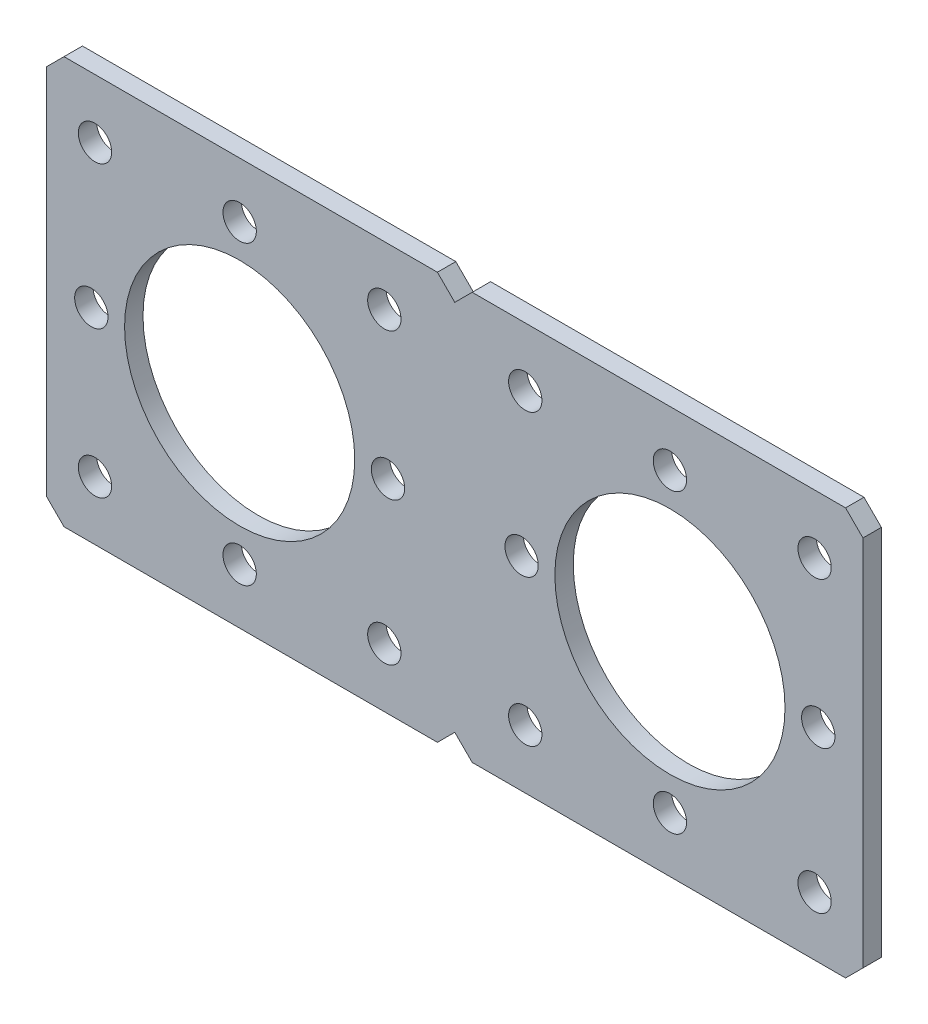
ISO-10303-21;
HEADER;
FILE_DESCRIPTION(('STEP AP214'),'2;1');
FILE_NAME('part.step','',(''),(''),'','','');
FILE_SCHEMA(('AUTOMOTIVE_DESIGN { 1 0 10303 214 1 1 1 1 }'));
ENDSEC;
DATA;
#1=APPLICATION_CONTEXT('core data for automotive mechanical design processes');
#2=APPLICATION_PROTOCOL_DEFINITION('international standard','automotive_design',2000,#1);
#3=PRODUCT_CONTEXT('',#1,'mechanical');
#4=PRODUCT('Part','Part','',(#3));
#5=PRODUCT_RELATED_PRODUCT_CATEGORY('part','',(#4));
#6=PRODUCT_DEFINITION_FORMATION('','',#4);
#7=PRODUCT_DEFINITION_CONTEXT('part definition',#1,'design');
#8=PRODUCT_DEFINITION('design','',#6,#7);
#9=PRODUCT_DEFINITION_SHAPE('','',#8);
#10=(LENGTH_UNIT() NAMED_UNIT(*) SI_UNIT(.MILLI.,.METRE.));
#11=(NAMED_UNIT(*) PLANE_ANGLE_UNIT() SI_UNIT($,.RADIAN.));
#12=(NAMED_UNIT(*) SI_UNIT($,.STERADIAN.) SOLID_ANGLE_UNIT());
#13=UNCERTAINTY_MEASURE_WITH_UNIT(LENGTH_MEASURE(1.E-05),#10,'distance_accuracy_value','');
#14=(GEOMETRIC_REPRESENTATION_CONTEXT(3) GLOBAL_UNCERTAINTY_ASSIGNED_CONTEXT((#13)) GLOBAL_UNIT_ASSIGNED_CONTEXT((#10,
#11,#12)) REPRESENTATION_CONTEXT('',''));
#15=CARTESIAN_POINT('',(0.,0.,0.));
#16=DIRECTION('',(0.,0.,1.));
#17=DIRECTION('',(1.,0.,0.));
#18=AXIS2_PLACEMENT_3D('',#15,#16,#17);
#19=CARTESIAN_POINT('',(-50.673,-25.273,0.));
#20=DIRECTION('',(0.,0.,1.));
#21=DIRECTION('',(1.,0.,0.));
#22=AXIS2_PLACEMENT_3D('',#19,#20,#21);
#23=PLANE('',#22);
#24=DIRECTION('',(-0.707106781186546,-0.707106781186549,0.));
#25=VECTOR('',#24,1.);
#26=CARTESIAN_POINT('',(-2.15899999999999,-25.273,0.));
#27=LINE('',#26,#25);
#28=CARTESIAN_POINT('',(0.,-23.114,0.));
#29=VERTEX_POINT('',#28);
#30=CARTESIAN_POINT('',(-2.15899999999998,-25.273,0.));
#31=VERTEX_POINT('',#30);
#32=EDGE_CURVE('E119',#29,#31,#27,.T.);
#33=ORIENTED_EDGE('',*,*,#32,.T.);
#34=DIRECTION('',(1.,0.,0.));
#35=VECTOR('',#34,1.);
#36=CARTESIAN_POINT('',(-50.673,-25.273,0.));
#37=LINE('',#36,#35);
#38=CARTESIAN_POINT('',(-48.514,-25.273,0.));
#39=VERTEX_POINT('',#38);
#40=EDGE_CURVE('E738',#31,#39,#37,.F.);
#41=ORIENTED_EDGE('',*,*,#40,.T.);
#42=DIRECTION('',(-0.707106781186548,0.707106781186548,0.));
#43=VECTOR('',#42,1.);
#44=CARTESIAN_POINT('',(-48.514,-25.273,0.));
#45=LINE('',#44,#43);
#46=CARTESIAN_POINT('',(-50.673,-23.114,0.));
#47=VERTEX_POINT('',#46);
#48=EDGE_CURVE('E742',#39,#47,#45,.T.);
#49=ORIENTED_EDGE('',*,*,#48,.T.);
#50=DIRECTION('',(0.,1.,0.));
#51=VECTOR('',#50,1.);
#52=CARTESIAN_POINT('',(-50.673,25.273,0.));
#53=LINE('',#52,#51);
#54=CARTESIAN_POINT('',(-50.673,23.114,0.));
#55=VERTEX_POINT('',#54);
#56=EDGE_CURVE('E746',#47,#55,#53,.T.);
#57=ORIENTED_EDGE('',*,*,#56,.T.);
#58=DIRECTION('',(0.707106781186548,0.707106781186548,0.));
#59=VECTOR('',#58,1.);
#60=CARTESIAN_POINT('',(-50.673,23.114,0.));
#61=LINE('',#60,#59);
#62=CARTESIAN_POINT('',(-48.514,25.273,0.));
#63=VERTEX_POINT('',#62);
#64=EDGE_CURVE('E750',#55,#63,#61,.T.);
#65=ORIENTED_EDGE('',*,*,#64,.T.);
#66=DIRECTION('',(1.,0.,0.));
#67=VECTOR('',#66,1.);
#68=CARTESIAN_POINT('',(-50.673,25.273,0.));
#69=LINE('',#68,#67);
#70=CARTESIAN_POINT('',(-2.15900000000001,25.273,0.));
#71=VERTEX_POINT('',#70);
#72=EDGE_CURVE('E754',#63,#71,#69,.T.);
#73=ORIENTED_EDGE('',*,*,#72,.T.);
#74=DIRECTION('',(0.707106781186546,-0.707106781186549,0.));
#75=VECTOR('',#74,1.);
#76=CARTESIAN_POINT('',(-2.15899999999999,25.273,0.));
#77=LINE('',#76,#75);
#78=CARTESIAN_POINT('',(0.,23.114,0.));
#79=VERTEX_POINT('',#78);
#80=EDGE_CURVE('E758',#71,#79,#77,.T.);
#81=ORIENTED_EDGE('',*,*,#80,.T.);
#82=DIRECTION('',(0.707106781186546,0.707106781186549,0.));
#83=VECTOR('',#82,1.);
#84=CARTESIAN_POINT('',(0.,23.114,0.));
#85=LINE('',#84,#83);
#86=CARTESIAN_POINT('',(2.15899999999998,25.273,0.));
#87=VERTEX_POINT('',#86);
#88=EDGE_CURVE('E762',#79,#87,#85,.T.);
#89=ORIENTED_EDGE('',*,*,#88,.T.);
#90=DIRECTION('',(1.,0.,0.));
#91=VECTOR('',#90,1.);
#92=CARTESIAN_POINT('',(-50.673,25.273,0.));
#93=LINE('',#92,#91);
#94=CARTESIAN_POINT('',(48.514,25.273,0.));
#95=VERTEX_POINT('',#94);
#96=EDGE_CURVE('E766',#87,#95,#93,.T.);
#97=ORIENTED_EDGE('',*,*,#96,.T.);
#98=DIRECTION('',(0.707106781186548,-0.707106781186548,0.));
#99=VECTOR('',#98,1.);
#100=CARTESIAN_POINT('',(48.514,25.273,0.));
#101=LINE('',#100,#99);
#102=CARTESIAN_POINT('',(50.673,23.114,0.));
#103=VERTEX_POINT('',#102);
#104=EDGE_CURVE('E770',#95,#103,#101,.T.);
#105=ORIENTED_EDGE('',*,*,#104,.T.);
#106=DIRECTION('',(0.,1.,0.));
#107=VECTOR('',#106,1.);
#108=CARTESIAN_POINT('',(50.673,25.273,0.));
#109=LINE('',#108,#107);
#110=CARTESIAN_POINT('',(50.673,-23.114,0.));
#111=VERTEX_POINT('',#110);
#112=EDGE_CURVE('E726',#103,#111,#109,.F.);
#113=ORIENTED_EDGE('',*,*,#112,.T.);
#114=DIRECTION('',(-0.707106781186548,-0.707106781186548,0.));
#115=VECTOR('',#114,1.);
#116=CARTESIAN_POINT('',(50.673,-23.114,0.));
#117=LINE('',#116,#115);
#118=CARTESIAN_POINT('',(48.514,-25.273,0.));
#119=VERTEX_POINT('',#118);
#120=EDGE_CURVE('E719',#111,#119,#117,.T.);
#121=ORIENTED_EDGE('',*,*,#120,.T.);
#122=DIRECTION('',(1.,0.,0.));
#123=VECTOR('',#122,1.);
#124=CARTESIAN_POINT('',(-50.673,-25.273,0.));
#125=LINE('',#124,#123);
#126=CARTESIAN_POINT('',(2.159,-25.273,0.));
#127=VERTEX_POINT('',#126);
#128=EDGE_CURVE('E114',#119,#127,#125,.F.);
#129=ORIENTED_EDGE('',*,*,#128,.T.);
#130=DIRECTION('',(-0.707106781186546,0.707106781186549,0.));
#131=VECTOR('',#130,1.);
#132=CARTESIAN_POINT('',(0.,-23.114,0.));
#133=LINE('',#132,#131);
#134=EDGE_CURVE('E116',#127,#29,#133,.T.);
#135=ORIENTED_EDGE('',*,*,#134,.T.);
#136=EDGE_LOOP('',(#33,#41,#49,#57,#65,#73,#81,#89,#97,#105,#113,#121,#129,#135));
#137=FACE_BOUND('',#136,.T.);
#138=CARTESIAN_POINT('',(-26.7081,-18.415,0.));
#139=DIRECTION('',(0.,0.,-1.));
#140=DIRECTION('',(-1.,0.,0.));
#141=AXIS2_PLACEMENT_3D('',#138,#139,#140);
#142=CIRCLE('',#141,2.0701);
#143=CARTESIAN_POINT('',(-28.7782,-18.415,0.));
#144=VERTEX_POINT('',#143);
#145=EDGE_CURVE('E132',#144,#144,#142,.F.);
#146=ORIENTED_EDGE('',*,*,#145,.T.);
#147=EDGE_LOOP('',(#146));
#148=FACE_BOUND('',#147,.T.);
#149=CARTESIAN_POINT('',(45.1231,0.,0.));
#150=DIRECTION('',(0.,0.,-1.));
#151=DIRECTION('',(-1.,0.,0.));
#152=AXIS2_PLACEMENT_3D('',#149,#150,#151);
#153=CIRCLE('',#152,2.07010000000001);
#154=CARTESIAN_POINT('',(43.053,0.,0.));
#155=VERTEX_POINT('',#154);
#156=EDGE_CURVE('E200',#155,#155,#153,.F.);
#157=ORIENTED_EDGE('',*,*,#156,.T.);
#158=EDGE_LOOP('',(#157));
#159=FACE_BOUND('',#158,.T.);
#160=CARTESIAN_POINT('',(-26.7080999999999,18.415,0.));
#161=DIRECTION('',(0.,0.,-1.));
#162=DIRECTION('',(-1.,0.,0.));
#163=AXIS2_PLACEMENT_3D('',#160,#161,#162);
#164=CIRCLE('',#163,2.0701);
#165=CARTESIAN_POINT('',(-28.7781999999999,18.415,0.));
#166=VERTEX_POINT('',#165);
#167=EDGE_CURVE('E203',#166,#166,#164,.F.);
#168=ORIENTED_EDGE('',*,*,#167,.T.);
#169=EDGE_LOOP('',(#168));
#170=FACE_BOUND('',#169,.T.);
#171=CARTESIAN_POINT('',(26.7080999999999,18.415,0.));
#172=DIRECTION('',(0.,0.,-1.));
#173=DIRECTION('',(-1.,0.,0.));
#174=AXIS2_PLACEMENT_3D('',#171,#172,#173);
#175=CIRCLE('',#174,2.0701);
#176=CARTESIAN_POINT('',(24.6379999999999,18.415,0.));
#177=VERTEX_POINT('',#176);
#178=EDGE_CURVE('E206',#177,#177,#175,.F.);
#179=ORIENTED_EDGE('',*,*,#178,.T.);
#180=EDGE_LOOP('',(#179));
#181=FACE_BOUND('',#180,.T.);
#182=CARTESIAN_POINT('',(-8.74758775786172,17.9605122421382,0.));
#183=DIRECTION('',(0.,0.,-1.));
#184=DIRECTION('',(-1.,0.,0.));
#185=AXIS2_PLACEMENT_3D('',#182,#183,#184);
#186=CIRCLE('',#185,2.0701);
#187=CARTESIAN_POINT('',(-10.8176877578617,17.9605122421382,0.));
#188=VERTEX_POINT('',#187);
#189=EDGE_CURVE('E209',#188,#188,#186,.F.);
#190=ORIENTED_EDGE('',*,*,#189,.T.);
#191=EDGE_LOOP('',(#190));
#192=FACE_BOUND('',#191,.T.);
#193=CARTESIAN_POINT('',(-44.6686122421384,17.9605122421382,0.));
#194=DIRECTION('',(0.,0.,-1.));
#195=DIRECTION('',(-1.,0.,0.));
#196=AXIS2_PLACEMENT_3D('',#193,#194,#195);
#197=CIRCLE('',#196,2.0701);
#198=CARTESIAN_POINT('',(-46.7387122421384,17.9605122421382,0.));
#199=VERTEX_POINT('',#198);
#200=EDGE_CURVE('E212',#199,#199,#197,.F.);
#201=ORIENTED_EDGE('',*,*,#200,.T.);
#202=EDGE_LOOP('',(#201));
#203=FACE_BOUND('',#202,.T.);
#204=CARTESIAN_POINT('',(-26.7081,0.,0.));
#205=DIRECTION('',(0.,0.,-1.));
#206=DIRECTION('',(-1.,0.,0.));
#207=AXIS2_PLACEMENT_3D('',#204,#205,#206);
#208=CIRCLE('',#207,14.2875);
#209=CARTESIAN_POINT('',(-40.9956,0.,0.));
#210=VERTEX_POINT('',#209);
#211=EDGE_CURVE('E215',#210,#210,#208,.F.);
#212=ORIENTED_EDGE('',*,*,#211,.T.);
#213=EDGE_LOOP('',(#212));
#214=FACE_BOUND('',#213,.T.);
#215=CARTESIAN_POINT('',(44.6686122421383,-17.9605122421383,0.));
#216=DIRECTION('',(0.,0.,-1.));
#217=DIRECTION('',(-1.,0.,0.));
#218=AXIS2_PLACEMENT_3D('',#215,#216,#217);
#219=CIRCLE('',#218,2.0701);
#220=CARTESIAN_POINT('',(42.5985122421383,-17.9605122421383,0.));
#221=VERTEX_POINT('',#220);
#222=EDGE_CURVE('E218',#221,#221,#219,.F.);
#223=ORIENTED_EDGE('',*,*,#222,.T.);
#224=EDGE_LOOP('',(#223));
#225=FACE_BOUND('',#224,.T.);
#226=CARTESIAN_POINT('',(8.74758775786166,17.9605122421383,0.));
#227=DIRECTION('',(0.,0.,-1.));
#228=DIRECTION('',(-1.,0.,0.));
#229=AXIS2_PLACEMENT_3D('',#226,#227,#228);
#230=CIRCLE('',#229,2.0701);
#231=CARTESIAN_POINT('',(6.67748775786166,17.9605122421383,0.));
#232=VERTEX_POINT('',#231);
#233=EDGE_CURVE('E221',#232,#232,#230,.F.);
#234=ORIENTED_EDGE('',*,*,#233,.T.);
#235=EDGE_LOOP('',(#234));
#236=FACE_BOUND('',#235,.T.);
#237=CARTESIAN_POINT('',(26.7081,0.,0.));
#238=DIRECTION('',(0.,0.,-1.));
#239=DIRECTION('',(-1.,0.,0.));
#240=AXIS2_PLACEMENT_3D('',#237,#238,#239);
#241=CIRCLE('',#240,14.2875);
#242=CARTESIAN_POINT('',(12.4206,0.,0.));
#243=VERTEX_POINT('',#242);
#244=EDGE_CURVE('E224',#243,#243,#241,.F.);
#245=ORIENTED_EDGE('',*,*,#244,.T.);
#246=EDGE_LOOP('',(#245));
#247=FACE_BOUND('',#246,.T.);
#248=CARTESIAN_POINT('',(8.74758775786161,-17.9605122421383,0.));
#249=DIRECTION('',(0.,0.,-1.));
#250=DIRECTION('',(-1.,0.,0.));
#251=AXIS2_PLACEMENT_3D('',#248,#249,#250);
#252=CIRCLE('',#251,2.0701);
#253=CARTESIAN_POINT('',(6.67748775786161,-17.9605122421383,0.));
#254=VERTEX_POINT('',#253);
#255=EDGE_CURVE('E227',#254,#254,#252,.F.);
#256=ORIENTED_EDGE('',*,*,#255,.T.);
#257=EDGE_LOOP('',(#256));
#258=FACE_BOUND('',#257,.T.);
#259=CARTESIAN_POINT('',(44.6686122421383,17.9605122421382,0.));
#260=DIRECTION('',(0.,0.,-1.));
#261=DIRECTION('',(-1.,0.,0.));
#262=AXIS2_PLACEMENT_3D('',#259,#260,#261);
#263=CIRCLE('',#262,2.0701);
#264=CARTESIAN_POINT('',(42.5985122421383,17.9605122421382,0.));
#265=VERTEX_POINT('',#264);
#266=EDGE_CURVE('E230',#265,#265,#263,.F.);
#267=ORIENTED_EDGE('',*,*,#266,.T.);
#268=EDGE_LOOP('',(#267));
#269=FACE_BOUND('',#268,.T.);
#270=CARTESIAN_POINT('',(-44.6686122421382,-17.9605122421383,0.));
#271=DIRECTION('',(0.,0.,-1.));
#272=DIRECTION('',(-1.,0.,0.));
#273=AXIS2_PLACEMENT_3D('',#270,#271,#272);
#274=CIRCLE('',#273,2.0701);
#275=CARTESIAN_POINT('',(-46.7387122421382,-17.9605122421383,0.));
#276=VERTEX_POINT('',#275);
#277=EDGE_CURVE('E233',#276,#276,#274,.F.);
#278=ORIENTED_EDGE('',*,*,#277,.T.);
#279=EDGE_LOOP('',(#278));
#280=FACE_BOUND('',#279,.T.);
#281=CARTESIAN_POINT('',(-8.7475877578617,-17.9605122421383,0.));
#282=DIRECTION('',(0.,0.,-1.));
#283=DIRECTION('',(-1.,0.,0.));
#284=AXIS2_PLACEMENT_3D('',#281,#282,#283);
#285=CIRCLE('',#284,2.0701);
#286=CARTESIAN_POINT('',(-10.8176877578617,-17.9605122421383,0.));
#287=VERTEX_POINT('',#286);
#288=EDGE_CURVE('E236',#287,#287,#285,.F.);
#289=ORIENTED_EDGE('',*,*,#288,.T.);
#290=EDGE_LOOP('',(#289));
#291=FACE_BOUND('',#290,.T.);
#292=CARTESIAN_POINT('',(8.29310000000001,-1.73472347597681E-13,0.));
#293=DIRECTION('',(0.,0.,-1.));
#294=DIRECTION('',(-1.,0.,0.));
#295=AXIS2_PLACEMENT_3D('',#292,#293,#294);
#296=CIRCLE('',#295,2.0701);
#297=CARTESIAN_POINT('',(6.22300000000001,-1.73472347597681E-13,0.));
#298=VERTEX_POINT('',#297);
#299=EDGE_CURVE('E239',#298,#298,#296,.F.);
#300=ORIENTED_EDGE('',*,*,#299,.T.);
#301=EDGE_LOOP('',(#300));
#302=FACE_BOUND('',#301,.T.);
#303=CARTESIAN_POINT('',(-45.1231,0.,0.));
#304=DIRECTION('',(0.,0.,-1.));
#305=DIRECTION('',(-1.,0.,0.));
#306=AXIS2_PLACEMENT_3D('',#303,#304,#305);
#307=CIRCLE('',#306,2.07010000000001);
#308=CARTESIAN_POINT('',(-47.1932,0.,0.));
#309=VERTEX_POINT('',#308);
#310=EDGE_CURVE('E242',#309,#309,#307,.F.);
#311=ORIENTED_EDGE('',*,*,#310,.T.);
#312=EDGE_LOOP('',(#311));
#313=FACE_BOUND('',#312,.T.);
#314=CARTESIAN_POINT('',(-8.2931,-1.87350135405495E-13,0.));
#315=DIRECTION('',(0.,0.,-1.));
#316=DIRECTION('',(-1.,0.,0.));
#317=AXIS2_PLACEMENT_3D('',#314,#315,#316);
#318=CIRCLE('',#317,2.0701);
#319=CARTESIAN_POINT('',(-10.3632,-1.87350135405495E-13,0.));
#320=VERTEX_POINT('',#319);
#321=EDGE_CURVE('E244',#320,#320,#318,.F.);
#322=ORIENTED_EDGE('',*,*,#321,.T.);
#323=EDGE_LOOP('',(#322));
#324=FACE_BOUND('',#323,.T.);
#325=CARTESIAN_POINT('',(26.7081,-18.415,0.));
#326=DIRECTION('',(0.,0.,-1.));
#327=DIRECTION('',(-1.,0.,0.));
#328=AXIS2_PLACEMENT_3D('',#325,#326,#327);
#329=CIRCLE('',#328,2.0701);
#330=CARTESIAN_POINT('',(24.638,-18.415,0.));
#331=VERTEX_POINT('',#330);
#332=EDGE_CURVE('E18',#331,#331,#329,.F.);
#333=ORIENTED_EDGE('',*,*,#332,.T.);
#334=EDGE_LOOP('',(#333));
#335=FACE_BOUND('',#334,.T.);
#336=ADVANCED_FACE('F15',(#137,#148,#159,#170,#181,#192,#203,#214,#225,#236,#247,#258,#269,#280,
#291,#302,#313,#324,#335),#23,.F.);
#337=CARTESIAN_POINT('',(26.7081,-18.415,2.286));
#338=DIRECTION('',(0.,0.,-1.));
#339=DIRECTION('',(-1.,0.,0.));
#340=AXIS2_PLACEMENT_3D('',#337,#338,#339);
#341=CYLINDRICAL_SURFACE('',#340,2.0701);
#342=CARTESIAN_POINT('',(26.7081,-18.415,2.286));
#343=DIRECTION('',(0.,0.,-1.));
#344=DIRECTION('',(-1.,0.,0.));
#345=AXIS2_PLACEMENT_3D('',#342,#343,#344);
#346=CIRCLE('',#345,2.0701);
#347=CARTESIAN_POINT('',(24.638,-18.415,2.286));
#348=VERTEX_POINT('',#347);
#349=EDGE_CURVE('E195',#348,#348,#346,.T.);
#350=ORIENTED_EDGE('',*,*,#349,.F.);
#351=EDGE_LOOP('',(#350));
#352=FACE_BOUND('',#351,.T.);
#353=ORIENTED_EDGE('',*,*,#332,.F.);
#354=EDGE_LOOP('',(#353));
#355=FACE_BOUND('',#354,.T.);
#356=ADVANCED_FACE('F252',(#352,#355),#341,.F.);
#357=CARTESIAN_POINT('',(-8.2931,-1.87350135405495E-13,2.286));
#358=DIRECTION('',(0.,0.,-1.));
#359=DIRECTION('',(-1.,0.,0.));
#360=AXIS2_PLACEMENT_3D('',#357,#358,#359);
#361=CYLINDRICAL_SURFACE('',#360,2.0701);
#362=CARTESIAN_POINT('',(-8.2931,-1.87350135405495E-13,2.286));
#363=DIRECTION('',(0.,0.,-1.));
#364=DIRECTION('',(-1.,0.,0.));
#365=AXIS2_PLACEMENT_3D('',#362,#363,#364);
#366=CIRCLE('',#365,2.0701);
#367=CARTESIAN_POINT('',(-10.3632,-1.87350135405495E-13,2.286));
#368=VERTEX_POINT('',#367);
#369=EDGE_CURVE('E192',#368,#368,#366,.T.);
#370=ORIENTED_EDGE('',*,*,#369,.F.);
#371=EDGE_LOOP('',(#370));
#372=FACE_BOUND('',#371,.T.);
#373=ORIENTED_EDGE('',*,*,#321,.F.);
#374=EDGE_LOOP('',(#373));
#375=FACE_BOUND('',#374,.T.);
#376=ADVANCED_FACE('F254',(#372,#375),#361,.F.);
#377=CARTESIAN_POINT('',(-45.1231,0.,2.286));
#378=DIRECTION('',(0.,0.,-1.));
#379=DIRECTION('',(-1.,0.,0.));
#380=AXIS2_PLACEMENT_3D('',#377,#378,#379);
#381=CYLINDRICAL_SURFACE('',#380,2.07010000000001);
#382=CARTESIAN_POINT('',(-45.1231,0.,2.286));
#383=DIRECTION('',(0.,0.,-1.));
#384=DIRECTION('',(-1.,0.,0.));
#385=AXIS2_PLACEMENT_3D('',#382,#383,#384);
#386=CIRCLE('',#385,2.07010000000001);
#387=CARTESIAN_POINT('',(-47.1932,0.,2.286));
#388=VERTEX_POINT('',#387);
#389=EDGE_CURVE('E189',#388,#388,#386,.T.);
#390=ORIENTED_EDGE('',*,*,#389,.F.);
#391=EDGE_LOOP('',(#390));
#392=FACE_BOUND('',#391,.T.);
#393=ORIENTED_EDGE('',*,*,#310,.F.);
#394=EDGE_LOOP('',(#393));
#395=FACE_BOUND('',#394,.T.);
#396=ADVANCED_FACE('F261',(#392,#395),#381,.F.);
#397=CARTESIAN_POINT('',(8.29310000000001,-1.73472347597681E-13,2.286));
#398=DIRECTION('',(0.,0.,-1.));
#399=DIRECTION('',(-1.,0.,0.));
#400=AXIS2_PLACEMENT_3D('',#397,#398,#399);
#401=CYLINDRICAL_SURFACE('',#400,2.0701);
#402=CARTESIAN_POINT('',(8.29310000000001,-1.73472347597681E-13,2.286));
#403=DIRECTION('',(0.,0.,-1.));
#404=DIRECTION('',(-1.,0.,0.));
#405=AXIS2_PLACEMENT_3D('',#402,#403,#404);
#406=CIRCLE('',#405,2.0701);
#407=CARTESIAN_POINT('',(6.22300000000001,-1.73472347597681E-13,2.286));
#408=VERTEX_POINT('',#407);
#409=EDGE_CURVE('E186',#408,#408,#406,.T.);
#410=ORIENTED_EDGE('',*,*,#409,.F.);
#411=EDGE_LOOP('',(#410));
#412=FACE_BOUND('',#411,.T.);
#413=ORIENTED_EDGE('',*,*,#299,.F.);
#414=EDGE_LOOP('',(#413));
#415=FACE_BOUND('',#414,.T.);
#416=ADVANCED_FACE('F380',(#412,#415),#401,.F.);
#417=CARTESIAN_POINT('',(-8.7475877578617,-17.9605122421383,2.286));
#418=DIRECTION('',(0.,0.,-1.));
#419=DIRECTION('',(-1.,0.,0.));
#420=AXIS2_PLACEMENT_3D('',#417,#418,#419);
#421=CYLINDRICAL_SURFACE('',#420,2.0701);
#422=CARTESIAN_POINT('',(-8.7475877578617,-17.9605122421383,2.286));
#423=DIRECTION('',(0.,0.,-1.));
#424=DIRECTION('',(-1.,0.,0.));
#425=AXIS2_PLACEMENT_3D('',#422,#423,#424);
#426=CIRCLE('',#425,2.0701);
#427=CARTESIAN_POINT('',(-10.8176877578617,-17.9605122421383,2.286));
#428=VERTEX_POINT('',#427);
#429=EDGE_CURVE('E183',#428,#428,#426,.T.);
#430=ORIENTED_EDGE('',*,*,#429,.F.);
#431=EDGE_LOOP('',(#430));
#432=FACE_BOUND('',#431,.T.);
#433=ORIENTED_EDGE('',*,*,#288,.F.);
#434=EDGE_LOOP('',(#433));
#435=FACE_BOUND('',#434,.T.);
#436=ADVANCED_FACE('F376',(#432,#435),#421,.F.);
#437=CARTESIAN_POINT('',(-44.6686122421382,-17.9605122421383,2.286));
#438=DIRECTION('',(0.,0.,-1.));
#439=DIRECTION('',(-1.,0.,0.));
#440=AXIS2_PLACEMENT_3D('',#437,#438,#439);
#441=CYLINDRICAL_SURFACE('',#440,2.0701);
#442=CARTESIAN_POINT('',(-44.6686122421382,-17.9605122421383,2.286));
#443=DIRECTION('',(0.,0.,-1.));
#444=DIRECTION('',(-1.,0.,0.));
#445=AXIS2_PLACEMENT_3D('',#442,#443,#444);
#446=CIRCLE('',#445,2.0701);
#447=CARTESIAN_POINT('',(-46.7387122421382,-17.9605122421383,2.286));
#448=VERTEX_POINT('',#447);
#449=EDGE_CURVE('E180',#448,#448,#446,.T.);
#450=ORIENTED_EDGE('',*,*,#449,.F.);
#451=EDGE_LOOP('',(#450));
#452=FACE_BOUND('',#451,.T.);
#453=ORIENTED_EDGE('',*,*,#277,.F.);
#454=EDGE_LOOP('',(#453));
#455=FACE_BOUND('',#454,.T.);
#456=ADVANCED_FACE('F372',(#452,#455),#441,.F.);
#457=CARTESIAN_POINT('',(44.6686122421383,17.9605122421382,2.286));
#458=DIRECTION('',(0.,0.,-1.));
#459=DIRECTION('',(-1.,0.,0.));
#460=AXIS2_PLACEMENT_3D('',#457,#458,#459);
#461=CYLINDRICAL_SURFACE('',#460,2.0701);
#462=CARTESIAN_POINT('',(44.6686122421383,17.9605122421382,2.286));
#463=DIRECTION('',(0.,0.,-1.));
#464=DIRECTION('',(-1.,0.,0.));
#465=AXIS2_PLACEMENT_3D('',#462,#463,#464);
#466=CIRCLE('',#465,2.0701);
#467=CARTESIAN_POINT('',(42.5985122421383,17.9605122421382,2.286));
#468=VERTEX_POINT('',#467);
#469=EDGE_CURVE('E177',#468,#468,#466,.T.);
#470=ORIENTED_EDGE('',*,*,#469,.F.);
#471=EDGE_LOOP('',(#470));
#472=FACE_BOUND('',#471,.T.);
#473=ORIENTED_EDGE('',*,*,#266,.F.);
#474=EDGE_LOOP('',(#473));
#475=FACE_BOUND('',#474,.T.);
#476=ADVANCED_FACE('F368',(#472,#475),#461,.F.);
#477=CARTESIAN_POINT('',(8.74758775786161,-17.9605122421383,2.286));
#478=DIRECTION('',(0.,0.,-1.));
#479=DIRECTION('',(-1.,0.,0.));
#480=AXIS2_PLACEMENT_3D('',#477,#478,#479);
#481=CYLINDRICAL_SURFACE('',#480,2.0701);
#482=CARTESIAN_POINT('',(8.74758775786161,-17.9605122421383,2.286));
#483=DIRECTION('',(0.,0.,-1.));
#484=DIRECTION('',(-1.,0.,0.));
#485=AXIS2_PLACEMENT_3D('',#482,#483,#484);
#486=CIRCLE('',#485,2.0701);
#487=CARTESIAN_POINT('',(6.67748775786161,-17.9605122421383,2.286));
#488=VERTEX_POINT('',#487);
#489=EDGE_CURVE('E174',#488,#488,#486,.T.);
#490=ORIENTED_EDGE('',*,*,#489,.F.);
#491=EDGE_LOOP('',(#490));
#492=FACE_BOUND('',#491,.T.);
#493=ORIENTED_EDGE('',*,*,#255,.F.);
#494=EDGE_LOOP('',(#493));
#495=FACE_BOUND('',#494,.T.);
#496=ADVANCED_FACE('F364',(#492,#495),#481,.F.);
#497=CARTESIAN_POINT('',(26.7081,0.,2.286));
#498=DIRECTION('',(0.,0.,-1.));
#499=DIRECTION('',(-1.,0.,0.));
#500=AXIS2_PLACEMENT_3D('',#497,#498,#499);
#501=CYLINDRICAL_SURFACE('',#500,14.2875);
#502=CARTESIAN_POINT('',(26.7081,0.,2.286));
#503=DIRECTION('',(0.,0.,-1.));
#504=DIRECTION('',(-1.,0.,0.));
#505=AXIS2_PLACEMENT_3D('',#502,#503,#504);
#506=CIRCLE('',#505,14.2875);
#507=CARTESIAN_POINT('',(12.4206,0.,2.286));
#508=VERTEX_POINT('',#507);
#509=EDGE_CURVE('E171',#508,#508,#506,.T.);
#510=ORIENTED_EDGE('',*,*,#509,.F.);
#511=EDGE_LOOP('',(#510));
#512=FACE_BOUND('',#511,.T.);
#513=ORIENTED_EDGE('',*,*,#244,.F.);
#514=EDGE_LOOP('',(#513));
#515=FACE_BOUND('',#514,.T.);
#516=ADVANCED_FACE('F360',(#512,#515),#501,.F.);
#517=CARTESIAN_POINT('',(8.74758775786166,17.9605122421383,2.286));
#518=DIRECTION('',(0.,0.,-1.));
#519=DIRECTION('',(-1.,0.,0.));
#520=AXIS2_PLACEMENT_3D('',#517,#518,#519);
#521=CYLINDRICAL_SURFACE('',#520,2.0701);
#522=CARTESIAN_POINT('',(8.74758775786166,17.9605122421383,2.286));
#523=DIRECTION('',(0.,0.,-1.));
#524=DIRECTION('',(-1.,0.,0.));
#525=AXIS2_PLACEMENT_3D('',#522,#523,#524);
#526=CIRCLE('',#525,2.0701);
#527=CARTESIAN_POINT('',(6.67748775786166,17.9605122421383,2.286));
#528=VERTEX_POINT('',#527);
#529=EDGE_CURVE('E168',#528,#528,#526,.T.);
#530=ORIENTED_EDGE('',*,*,#529,.F.);
#531=EDGE_LOOP('',(#530));
#532=FACE_BOUND('',#531,.T.);
#533=ORIENTED_EDGE('',*,*,#233,.F.);
#534=EDGE_LOOP('',(#533));
#535=FACE_BOUND('',#534,.T.);
#536=ADVANCED_FACE('F356',(#532,#535),#521,.F.);
#537=CARTESIAN_POINT('',(44.6686122421383,-17.9605122421383,2.286));
#538=DIRECTION('',(0.,0.,-1.));
#539=DIRECTION('',(-1.,0.,0.));
#540=AXIS2_PLACEMENT_3D('',#537,#538,#539);
#541=CYLINDRICAL_SURFACE('',#540,2.0701);
#542=CARTESIAN_POINT('',(44.6686122421383,-17.9605122421383,2.286));
#543=DIRECTION('',(0.,0.,-1.));
#544=DIRECTION('',(-1.,0.,0.));
#545=AXIS2_PLACEMENT_3D('',#542,#543,#544);
#546=CIRCLE('',#545,2.0701);
#547=CARTESIAN_POINT('',(42.5985122421383,-17.9605122421383,2.286));
#548=VERTEX_POINT('',#547);
#549=EDGE_CURVE('E165',#548,#548,#546,.T.);
#550=ORIENTED_EDGE('',*,*,#549,.F.);
#551=EDGE_LOOP('',(#550));
#552=FACE_BOUND('',#551,.T.);
#553=ORIENTED_EDGE('',*,*,#222,.F.);
#554=EDGE_LOOP('',(#553));
#555=FACE_BOUND('',#554,.T.);
#556=ADVANCED_FACE('F352',(#552,#555),#541,.F.);
#557=CARTESIAN_POINT('',(-26.7081,0.,2.286));
#558=DIRECTION('',(0.,0.,-1.));
#559=DIRECTION('',(-1.,0.,0.));
#560=AXIS2_PLACEMENT_3D('',#557,#558,#559);
#561=CYLINDRICAL_SURFACE('',#560,14.2875);
#562=CARTESIAN_POINT('',(-26.7081,0.,2.286));
#563=DIRECTION('',(0.,0.,-1.));
#564=DIRECTION('',(-1.,0.,0.));
#565=AXIS2_PLACEMENT_3D('',#562,#563,#564);
#566=CIRCLE('',#565,14.2875);
#567=CARTESIAN_POINT('',(-40.9956,0.,2.286));
#568=VERTEX_POINT('',#567);
#569=EDGE_CURVE('E162',#568,#568,#566,.T.);
#570=ORIENTED_EDGE('',*,*,#569,.F.);
#571=EDGE_LOOP('',(#570));
#572=FACE_BOUND('',#571,.T.);
#573=ORIENTED_EDGE('',*,*,#211,.F.);
#574=EDGE_LOOP('',(#573));
#575=FACE_BOUND('',#574,.T.);
#576=ADVANCED_FACE('F348',(#572,#575),#561,.F.);
#577=CARTESIAN_POINT('',(-44.6686122421384,17.9605122421382,2.286));
#578=DIRECTION('',(0.,0.,-1.));
#579=DIRECTION('',(-1.,0.,0.));
#580=AXIS2_PLACEMENT_3D('',#577,#578,#579);
#581=CYLINDRICAL_SURFACE('',#580,2.0701);
#582=CARTESIAN_POINT('',(-44.6686122421384,17.9605122421382,2.286));
#583=DIRECTION('',(0.,0.,-1.));
#584=DIRECTION('',(-1.,0.,0.));
#585=AXIS2_PLACEMENT_3D('',#582,#583,#584);
#586=CIRCLE('',#585,2.0701);
#587=CARTESIAN_POINT('',(-46.7387122421384,17.9605122421382,2.286));
#588=VERTEX_POINT('',#587);
#589=EDGE_CURVE('E159',#588,#588,#586,.T.);
#590=ORIENTED_EDGE('',*,*,#589,.F.);
#591=EDGE_LOOP('',(#590));
#592=FACE_BOUND('',#591,.T.);
#593=ORIENTED_EDGE('',*,*,#200,.F.);
#594=EDGE_LOOP('',(#593));
#595=FACE_BOUND('',#594,.T.);
#596=ADVANCED_FACE('F344',(#592,#595),#581,.F.);
#597=CARTESIAN_POINT('',(-8.74758775786172,17.9605122421382,2.286));
#598=DIRECTION('',(0.,0.,-1.));
#599=DIRECTION('',(-1.,0.,0.));
#600=AXIS2_PLACEMENT_3D('',#597,#598,#599);
#601=CYLINDRICAL_SURFACE('',#600,2.0701);
#602=CARTESIAN_POINT('',(-8.74758775786172,17.9605122421382,2.286));
#603=DIRECTION('',(0.,0.,-1.));
#604=DIRECTION('',(-1.,0.,0.));
#605=AXIS2_PLACEMENT_3D('',#602,#603,#604);
#606=CIRCLE('',#605,2.0701);
#607=CARTESIAN_POINT('',(-10.8176877578617,17.9605122421382,2.286));
#608=VERTEX_POINT('',#607);
#609=EDGE_CURVE('E156',#608,#608,#606,.T.);
#610=ORIENTED_EDGE('',*,*,#609,.F.);
#611=EDGE_LOOP('',(#610));
#612=FACE_BOUND('',#611,.T.);
#613=ORIENTED_EDGE('',*,*,#189,.F.);
#614=EDGE_LOOP('',(#613));
#615=FACE_BOUND('',#614,.T.);
#616=ADVANCED_FACE('F340',(#612,#615),#601,.F.);
#617=CARTESIAN_POINT('',(26.7080999999999,18.415,2.286));
#618=DIRECTION('',(0.,0.,-1.));
#619=DIRECTION('',(-1.,0.,0.));
#620=AXIS2_PLACEMENT_3D('',#617,#618,#619);
#621=CYLINDRICAL_SURFACE('',#620,2.0701);
#622=CARTESIAN_POINT('',(26.7080999999999,18.415,2.286));
#623=DIRECTION('',(0.,0.,-1.));
#624=DIRECTION('',(-1.,0.,0.));
#625=AXIS2_PLACEMENT_3D('',#622,#623,#624);
#626=CIRCLE('',#625,2.0701);
#627=CARTESIAN_POINT('',(24.6379999999999,18.415,2.286));
#628=VERTEX_POINT('',#627);
#629=EDGE_CURVE('E153',#628,#628,#626,.T.);
#630=ORIENTED_EDGE('',*,*,#629,.F.);
#631=EDGE_LOOP('',(#630));
#632=FACE_BOUND('',#631,.T.);
#633=ORIENTED_EDGE('',*,*,#178,.F.);
#634=EDGE_LOOP('',(#633));
#635=FACE_BOUND('',#634,.T.);
#636=ADVANCED_FACE('F336',(#632,#635),#621,.F.);
#637=CARTESIAN_POINT('',(-26.7080999999999,18.415,2.286));
#638=DIRECTION('',(0.,0.,-1.));
#639=DIRECTION('',(-1.,0.,0.));
#640=AXIS2_PLACEMENT_3D('',#637,#638,#639);
#641=CYLINDRICAL_SURFACE('',#640,2.0701);
#642=CARTESIAN_POINT('',(-26.7080999999999,18.415,2.286));
#643=DIRECTION('',(0.,0.,-1.));
#644=DIRECTION('',(-1.,0.,0.));
#645=AXIS2_PLACEMENT_3D('',#642,#643,#644);
#646=CIRCLE('',#645,2.0701);
#647=CARTESIAN_POINT('',(-28.7781999999999,18.415,2.286));
#648=VERTEX_POINT('',#647);
#649=EDGE_CURVE('E150',#648,#648,#646,.T.);
#650=ORIENTED_EDGE('',*,*,#649,.F.);
#651=EDGE_LOOP('',(#650));
#652=FACE_BOUND('',#651,.T.);
#653=ORIENTED_EDGE('',*,*,#167,.F.);
#654=EDGE_LOOP('',(#653));
#655=FACE_BOUND('',#654,.T.);
#656=ADVANCED_FACE('F332',(#652,#655),#641,.F.);
#657=CARTESIAN_POINT('',(45.1231,0.,2.286));
#658=DIRECTION('',(0.,0.,-1.));
#659=DIRECTION('',(-1.,0.,0.));
#660=AXIS2_PLACEMENT_3D('',#657,#658,#659);
#661=CYLINDRICAL_SURFACE('',#660,2.07010000000001);
#662=CARTESIAN_POINT('',(45.1231,0.,2.286));
#663=DIRECTION('',(0.,0.,-1.));
#664=DIRECTION('',(-1.,0.,0.));
#665=AXIS2_PLACEMENT_3D('',#662,#663,#664);
#666=CIRCLE('',#665,2.07010000000001);
#667=CARTESIAN_POINT('',(43.053,0.,2.286));
#668=VERTEX_POINT('',#667);
#669=EDGE_CURVE('E147',#668,#668,#666,.T.);
#670=ORIENTED_EDGE('',*,*,#669,.F.);
#671=EDGE_LOOP('',(#670));
#672=FACE_BOUND('',#671,.T.);
#673=ORIENTED_EDGE('',*,*,#156,.F.);
#674=EDGE_LOOP('',(#673));
#675=FACE_BOUND('',#674,.T.);
#676=ADVANCED_FACE('F328',(#672,#675),#661,.F.);
#677=CARTESIAN_POINT('',(-26.7081,-18.415,2.286));
#678=DIRECTION('',(0.,0.,-1.));
#679=DIRECTION('',(-1.,0.,0.));
#680=AXIS2_PLACEMENT_3D('',#677,#678,#679);
#681=CYLINDRICAL_SURFACE('',#680,2.0701);
#682=CARTESIAN_POINT('',(-26.7081,-18.415,2.286));
#683=DIRECTION('',(0.,0.,-1.));
#684=DIRECTION('',(-1.,0.,0.));
#685=AXIS2_PLACEMENT_3D('',#682,#683,#684);
#686=CIRCLE('',#685,2.0701);
#687=CARTESIAN_POINT('',(-28.7782,-18.415,2.286));
#688=VERTEX_POINT('',#687);
#689=EDGE_CURVE('E143',#688,#688,#686,.T.);
#690=ORIENTED_EDGE('',*,*,#689,.F.);
#691=EDGE_LOOP('',(#690));
#692=FACE_BOUND('',#691,.T.);
#693=ORIENTED_EDGE('',*,*,#145,.F.);
#694=EDGE_LOOP('',(#693));
#695=FACE_BOUND('',#694,.T.);
#696=ADVANCED_FACE('F325',(#692,#695),#681,.F.);
#697=CARTESIAN_POINT('',(-2.15899999999999,-25.273,2.286));
#698=DIRECTION('',(-0.707106781186549,0.707106781186546,0.));
#699=DIRECTION('',(-0.707106781186546,-0.707106781186549,0.));
#700=AXIS2_PLACEMENT_3D('',#697,#698,#699);
#701=PLANE('',#700);
#702=DIRECTION('',(0.,0.,1.));
#703=VECTOR('',#702,1.);
#704=CARTESIAN_POINT('',(-2.15900000000001,-25.273,2.286));
#705=LINE('',#704,#703);
#706=CARTESIAN_POINT('',(-2.159,-25.273,2.286));
#707=VERTEX_POINT('',#706);
#708=EDGE_CURVE('E130',#707,#31,#705,.F.);
#709=ORIENTED_EDGE('',*,*,#708,.T.);
#710=ORIENTED_EDGE('',*,*,#32,.F.);
#711=DIRECTION('',(0.,0.,1.));
#712=VECTOR('',#711,1.);
#713=CARTESIAN_POINT('',(0.,-23.114,2.286));
#714=LINE('',#713,#712);
#715=CARTESIAN_POINT('',(0.,-23.114,2.286));
#716=VERTEX_POINT('',#715);
#717=EDGE_CURVE('E124',#29,#716,#714,.T.);
#718=ORIENTED_EDGE('',*,*,#717,.T.);
#719=DIRECTION('',(0.707106781186552,0.707106781186544,0.));
#720=VECTOR('',#719,1.);
#721=CARTESIAN_POINT('',(-2.15900000000001,-25.273,2.286));
#722=LINE('',#721,#720);
#723=EDGE_CURVE('E146',#707,#716,#722,.T.);
#724=ORIENTED_EDGE('',*,*,#723,.F.);
#725=EDGE_LOOP('',(#709,#710,#718,#724));
#726=FACE_BOUND('',#725,.T.);
#727=ADVANCED_FACE('F127',(#726),#701,.F.);
#728=CARTESIAN_POINT('',(0.,-23.114,2.286));
#729=DIRECTION('',(0.707106781186549,0.707106781186546,0.));
#730=DIRECTION('',(-0.707106781186546,0.707106781186549,0.));
#731=AXIS2_PLACEMENT_3D('',#728,#729,#730);
#732=PLANE('',#731);
#733=DIRECTION('',(0.707106781186545,-0.70710678118655,0.));
#734=VECTOR('',#733,1.);
#735=CARTESIAN_POINT('',(0.,-23.114,2.286));
#736=LINE('',#735,#734);
#737=CARTESIAN_POINT('',(2.15899999999999,-25.273,2.286));
#738=VERTEX_POINT('',#737);
#739=EDGE_CURVE('E136',#716,#738,#736,.T.);
#740=ORIENTED_EDGE('',*,*,#739,.F.);
#741=ORIENTED_EDGE('',*,*,#717,.F.);
#742=ORIENTED_EDGE('',*,*,#134,.F.);
#743=DIRECTION('',(0.,0.,1.));
#744=VECTOR('',#743,1.);
#745=CARTESIAN_POINT('',(2.15899999999999,-25.273,2.286));
#746=LINE('',#745,#744);
#747=EDGE_CURVE('E139',#127,#738,#746,.T.);
#748=ORIENTED_EDGE('',*,*,#747,.T.);
#749=EDGE_LOOP('',(#740,#741,#742,#748));
#750=FACE_BOUND('',#749,.T.);
#751=ADVANCED_FACE('F134',(#750),#732,.F.);
#752=CARTESIAN_POINT('',(-50.673,-25.273,2.286));
#753=DIRECTION('',(0.,1.,0.));
#754=DIRECTION('',(0.,0.,1.));
#755=AXIS2_PLACEMENT_3D('',#752,#753,#754);
#756=PLANE('',#755);
#757=ORIENTED_EDGE('',*,*,#128,.F.);
#758=DIRECTION('',(0.,0.,1.));
#759=VECTOR('',#758,1.);
#760=CARTESIAN_POINT('',(48.514,-25.273,2.286));
#761=LINE('',#760,#759);
#762=CARTESIAN_POINT('',(48.514,-25.273,2.286));
#763=VERTEX_POINT('',#762);
#764=EDGE_CURVE('E717',#119,#763,#761,.T.);
#765=ORIENTED_EDGE('',*,*,#764,.T.);
#766=DIRECTION('',(1.,0.,0.));
#767=VECTOR('',#766,1.);
#768=CARTESIAN_POINT('',(-50.673,-25.273,2.286));
#769=LINE('',#768,#767);
#770=EDGE_CURVE('E730',#738,#763,#769,.T.);
#771=ORIENTED_EDGE('',*,*,#770,.F.);
#772=ORIENTED_EDGE('',*,*,#747,.F.);
#773=EDGE_LOOP('',(#757,#765,#771,#772));
#774=FACE_BOUND('',#773,.T.);
#775=ADVANCED_FACE('F316',(#774),#756,.F.);
#776=CARTESIAN_POINT('',(50.673,-23.114,2.286));
#777=DIRECTION('',(-0.707106781186548,0.707106781186548,0.));
#778=DIRECTION('',(-0.707106781186548,-0.707106781186548,0.));
#779=AXIS2_PLACEMENT_3D('',#776,#777,#778);
#780=PLANE('',#779);
#781=ORIENTED_EDGE('',*,*,#764,.F.);
#782=ORIENTED_EDGE('',*,*,#120,.F.);
#783=DIRECTION('',(0.,0.,1.));
#784=VECTOR('',#783,1.);
#785=CARTESIAN_POINT('',(50.673,-23.114,2.286));
#786=LINE('',#785,#784);
#787=CARTESIAN_POINT('',(50.673,-23.114,2.286));
#788=VERTEX_POINT('',#787);
#789=EDGE_CURVE('E724',#111,#788,#786,.T.);
#790=ORIENTED_EDGE('',*,*,#789,.T.);
#791=DIRECTION('',(0.707106781186544,0.707106781186551,0.));
#792=VECTOR('',#791,1.);
#793=CARTESIAN_POINT('',(48.514,-25.273,2.286));
#794=LINE('',#793,#792);
#795=EDGE_CURVE('E722',#763,#788,#794,.T.);
#796=ORIENTED_EDGE('',*,*,#795,.F.);
#797=EDGE_LOOP('',(#781,#782,#790,#796));
#798=FACE_BOUND('',#797,.T.);
#799=ADVANCED_FACE('F312',(#798),#780,.F.);
#800=CARTESIAN_POINT('',(50.673,25.273,2.286));
#801=DIRECTION('',(-1.,0.,0.));
#802=DIRECTION('',(0.,0.,1.));
#803=AXIS2_PLACEMENT_3D('',#800,#801,#802);
#804=PLANE('',#803);
#805=DIRECTION('',(0.,0.,1.));
#806=VECTOR('',#805,1.);
#807=CARTESIAN_POINT('',(50.673,23.114,2.286));
#808=LINE('',#807,#806);
#809=CARTESIAN_POINT('',(50.673,23.114,2.286));
#810=VERTEX_POINT('',#809);
#811=EDGE_CURVE('E768',#103,#810,#808,.T.);
#812=ORIENTED_EDGE('',*,*,#811,.T.);
#813=DIRECTION('',(0.,1.,0.));
#814=VECTOR('',#813,1.);
#815=CARTESIAN_POINT('',(50.673,-25.273,2.286));
#816=LINE('',#815,#814);
#817=EDGE_CURVE('E777',#788,#810,#816,.T.);
#818=ORIENTED_EDGE('',*,*,#817,.F.);
#819=ORIENTED_EDGE('',*,*,#789,.F.);
#820=ORIENTED_EDGE('',*,*,#112,.F.);
#821=EDGE_LOOP('',(#812,#818,#819,#820));
#822=FACE_BOUND('',#821,.T.);
#823=ADVANCED_FACE('F308',(#822),#804,.F.);
#824=CARTESIAN_POINT('',(48.514,25.273,2.286));
#825=DIRECTION('',(-0.707106781186548,-0.707106781186548,0.));
#826=DIRECTION('',(0.707106781186548,-0.707106781186548,0.));
#827=AXIS2_PLACEMENT_3D('',#824,#825,#826);
#828=PLANE('',#827);
#829=ORIENTED_EDGE('',*,*,#811,.F.);
#830=ORIENTED_EDGE('',*,*,#104,.F.);
#831=DIRECTION('',(0.,0.,-1.));
#832=VECTOR('',#831,1.);
#833=CARTESIAN_POINT('',(48.514,25.273,2.286));
#834=LINE('',#833,#832);
#835=CARTESIAN_POINT('',(48.514,25.273,2.286));
#836=VERTEX_POINT('',#835);
#837=EDGE_CURVE('E764',#95,#836,#834,.F.);
#838=ORIENTED_EDGE('',*,*,#837,.T.);
#839=DIRECTION('',(-0.707106781186545,0.70710678118655,0.));
#840=VECTOR('',#839,1.);
#841=CARTESIAN_POINT('',(50.673,23.114,2.286));
#842=LINE('',#841,#840);
#843=EDGE_CURVE('E780',#810,#836,#842,.T.);
#844=ORIENTED_EDGE('',*,*,#843,.F.);
#845=EDGE_LOOP('',(#829,#830,#838,#844));
#846=FACE_BOUND('',#845,.T.);
#847=ADVANCED_FACE('F304',(#846),#828,.F.);
#848=CARTESIAN_POINT('',(-50.673,25.273,2.286));
#849=DIRECTION('',(0.,-1.,0.));
#850=DIRECTION('',(0.,0.,-1.));
#851=AXIS2_PLACEMENT_3D('',#848,#849,#850);
#852=PLANE('',#851);
#853=DIRECTION('',(1.,0.,0.));
#854=VECTOR('',#853,1.);
#855=CARTESIAN_POINT('',(-50.673,25.273,2.286));
#856=LINE('',#855,#854);
#857=CARTESIAN_POINT('',(2.15899999999998,25.273,2.286));
#858=VERTEX_POINT('',#857);
#859=EDGE_CURVE('E784',#836,#858,#856,.F.);
#860=ORIENTED_EDGE('',*,*,#859,.F.);
#861=ORIENTED_EDGE('',*,*,#837,.F.);
#862=ORIENTED_EDGE('',*,*,#96,.F.);
#863=DIRECTION('',(0.,0.,1.));
#864=VECTOR('',#863,1.);
#865=CARTESIAN_POINT('',(2.159,25.273,2.286));
#866=LINE('',#865,#864);
#867=EDGE_CURVE('E760',#87,#858,#866,.T.);
#868=ORIENTED_EDGE('',*,*,#867,.T.);
#869=EDGE_LOOP('',(#860,#861,#862,#868));
#870=FACE_BOUND('',#869,.T.);
#871=ADVANCED_FACE('F300',(#870),#852,.F.);
#872=CARTESIAN_POINT('',(0.,23.114,2.286));
#873=DIRECTION('',(0.707106781186549,-0.707106781186546,0.));
#874=DIRECTION('',(0.707106781186546,0.707106781186549,0.));
#875=AXIS2_PLACEMENT_3D('',#872,#873,#874);
#876=PLANE('',#875);
#877=ORIENTED_EDGE('',*,*,#867,.F.);
#878=ORIENTED_EDGE('',*,*,#88,.F.);
#879=DIRECTION('',(0.,0.,1.));
#880=VECTOR('',#879,1.);
#881=CARTESIAN_POINT('',(0.,23.114,2.286));
#882=LINE('',#881,#880);
#883=CARTESIAN_POINT('',(0.,23.114,2.286));
#884=VERTEX_POINT('',#883);
#885=EDGE_CURVE('E756',#79,#884,#882,.T.);
#886=ORIENTED_EDGE('',*,*,#885,.T.);
#887=DIRECTION('',(-0.707106781186542,-0.707106781186553,0.));
#888=VECTOR('',#887,1.);
#889=CARTESIAN_POINT('',(2.15899999999997,25.273,2.286));
#890=LINE('',#889,#888);
#891=EDGE_CURVE('E787',#858,#884,#890,.T.);
#892=ORIENTED_EDGE('',*,*,#891,.F.);
#893=EDGE_LOOP('',(#877,#878,#886,#892));
#894=FACE_BOUND('',#893,.T.);
#895=ADVANCED_FACE('F296',(#894),#876,.F.);
#896=CARTESIAN_POINT('',(-2.15899999999999,25.273,2.286));
#897=DIRECTION('',(-0.707106781186549,-0.707106781186546,0.));
#898=DIRECTION('',(0.707106781186546,-0.707106781186549,0.));
#899=AXIS2_PLACEMENT_3D('',#896,#897,#898);
#900=PLANE('',#899);
#901=DIRECTION('',(-0.707106781186549,0.707106781186546,0.));
#902=VECTOR('',#901,1.);
#903=CARTESIAN_POINT('',(0.,23.114,2.286));
#904=LINE('',#903,#902);
#905=CARTESIAN_POINT('',(-2.159,25.273,2.286));
#906=VERTEX_POINT('',#905);
#907=EDGE_CURVE('E790',#884,#906,#904,.T.);
#908=ORIENTED_EDGE('',*,*,#907,.F.);
#909=ORIENTED_EDGE('',*,*,#885,.F.);
#910=ORIENTED_EDGE('',*,*,#80,.F.);
#911=DIRECTION('',(0.,0.,-1.));
#912=VECTOR('',#911,1.);
#913=CARTESIAN_POINT('',(-2.15900000000001,25.273,2.286));
#914=LINE('',#913,#912);
#915=EDGE_CURVE('E752',#71,#906,#914,.F.);
#916=ORIENTED_EDGE('',*,*,#915,.T.);
#917=EDGE_LOOP('',(#908,#909,#910,#916));
#918=FACE_BOUND('',#917,.T.);
#919=ADVANCED_FACE('F292',(#918),#900,.F.);
#920=CARTESIAN_POINT('',(-50.673,25.273,2.286));
#921=DIRECTION('',(0.,-1.,0.));
#922=DIRECTION('',(0.,0.,-1.));
#923=AXIS2_PLACEMENT_3D('',#920,#921,#922);
#924=PLANE('',#923);
#925=ORIENTED_EDGE('',*,*,#72,.F.);
#926=DIRECTION('',(0.,0.,1.));
#927=VECTOR('',#926,1.);
#928=CARTESIAN_POINT('',(-48.514,25.273,2.286));
#929=LINE('',#928,#927);
#930=CARTESIAN_POINT('',(-48.514,25.273,2.286));
#931=VERTEX_POINT('',#930);
#932=EDGE_CURVE('E748',#63,#931,#929,.T.);
#933=ORIENTED_EDGE('',*,*,#932,.T.);
#934=DIRECTION('',(1.,0.,0.));
#935=VECTOR('',#934,1.);
#936=CARTESIAN_POINT('',(-50.673,25.273,2.286));
#937=LINE('',#936,#935);
#938=EDGE_CURVE('E793',#906,#931,#937,.F.);
#939=ORIENTED_EDGE('',*,*,#938,.F.);
#940=ORIENTED_EDGE('',*,*,#915,.F.);
#941=EDGE_LOOP('',(#925,#933,#939,#940));
#942=FACE_BOUND('',#941,.T.);
#943=ADVANCED_FACE('F288',(#942),#924,.F.);
#944=CARTESIAN_POINT('',(-50.673,23.114,2.286));
#945=DIRECTION('',(0.707106781186548,-0.707106781186548,0.));
#946=DIRECTION('',(0.707106781186548,0.707106781186548,0.));
#947=AXIS2_PLACEMENT_3D('',#944,#945,#946);
#948=PLANE('',#947);
#949=ORIENTED_EDGE('',*,*,#932,.F.);
#950=ORIENTED_EDGE('',*,*,#64,.F.);
#951=DIRECTION('',(0.,0.,-1.));
#952=VECTOR('',#951,1.);
#953=CARTESIAN_POINT('',(-50.673,23.114,2.286));
#954=LINE('',#953,#952);
#955=CARTESIAN_POINT('',(-50.673,23.114,2.286));
#956=VERTEX_POINT('',#955);
#957=EDGE_CURVE('E744',#55,#956,#954,.F.);
#958=ORIENTED_EDGE('',*,*,#957,.T.);
#959=DIRECTION('',(-0.707106781186549,-0.707106781186546,0.));
#960=VECTOR('',#959,1.);
#961=CARTESIAN_POINT('',(-48.514,25.273,2.286));
#962=LINE('',#961,#960);
#963=EDGE_CURVE('E796',#931,#956,#962,.T.);
#964=ORIENTED_EDGE('',*,*,#963,.F.);
#965=EDGE_LOOP('',(#949,#950,#958,#964));
#966=FACE_BOUND('',#965,.T.);
#967=ADVANCED_FACE('F284',(#966),#948,.F.);
#968=CARTESIAN_POINT('',(-50.673,25.273,2.286));
#969=DIRECTION('',(1.,0.,0.));
#970=DIRECTION('',(0.,0.,-1.));
#971=AXIS2_PLACEMENT_3D('',#968,#969,#970);
#972=PLANE('',#971);
#973=ORIENTED_EDGE('',*,*,#957,.F.);
#974=ORIENTED_EDGE('',*,*,#56,.F.);
#975=DIRECTION('',(0.,0.,1.));
#976=VECTOR('',#975,1.);
#977=CARTESIAN_POINT('',(-50.673,-23.114,2.286));
#978=LINE('',#977,#976);
#979=CARTESIAN_POINT('',(-50.673,-23.114,2.286));
#980=VERTEX_POINT('',#979);
#981=EDGE_CURVE('E740',#47,#980,#978,.T.);
#982=ORIENTED_EDGE('',*,*,#981,.T.);
#983=DIRECTION('',(0.,1.,0.));
#984=VECTOR('',#983,1.);
#985=CARTESIAN_POINT('',(-50.673,-25.273,2.286));
#986=LINE('',#985,#984);
#987=EDGE_CURVE('E799',#956,#980,#986,.F.);
#988=ORIENTED_EDGE('',*,*,#987,.F.);
#989=EDGE_LOOP('',(#973,#974,#982,#988));
#990=FACE_BOUND('',#989,.T.);
#991=ADVANCED_FACE('F281',(#990),#972,.F.);
#992=CARTESIAN_POINT('',(-48.514,-25.273,2.286));
#993=DIRECTION('',(0.707106781186548,0.707106781186548,0.));
#994=DIRECTION('',(-0.707106781186548,0.707106781186548,0.));
#995=AXIS2_PLACEMENT_3D('',#992,#993,#994);
#996=PLANE('',#995);
#997=ORIENTED_EDGE('',*,*,#981,.F.);
#998=ORIENTED_EDGE('',*,*,#48,.F.);
#999=DIRECTION('',(0.,0.,1.));
#1000=VECTOR('',#999,1.);
#1001=CARTESIAN_POINT('',(-48.514,-25.273,2.286));
#1002=LINE('',#1001,#1000);
#1003=CARTESIAN_POINT('',(-48.514,-25.273,2.286));
#1004=VERTEX_POINT('',#1003);
#1005=EDGE_CURVE('E33',#39,#1004,#1002,.T.);
#1006=ORIENTED_EDGE('',*,*,#1005,.T.);
#1007=DIRECTION('',(0.707106781186545,-0.70710678118655,0.));
#1008=VECTOR('',#1007,1.);
#1009=CARTESIAN_POINT('',(-50.673,-23.114,2.286));
#1010=LINE('',#1009,#1008);
#1011=EDGE_CURVE('E24',#980,#1004,#1010,.T.);
#1012=ORIENTED_EDGE('',*,*,#1011,.F.);
#1013=EDGE_LOOP('',(#997,#998,#1006,#1012));
#1014=FACE_BOUND('',#1013,.T.);
#1015=ADVANCED_FACE('F273',(#1014),#996,.F.);
#1016=CARTESIAN_POINT('',(-50.673,-25.273,2.286));
#1017=DIRECTION('',(0.,1.,0.));
#1018=DIRECTION('',(0.,0.,1.));
#1019=AXIS2_PLACEMENT_3D('',#1016,#1017,#1018);
#1020=PLANE('',#1019);
#1021=DIRECTION('',(1.,0.,0.));
#1022=VECTOR('',#1021,1.);
#1023=CARTESIAN_POINT('',(-50.673,-25.273,2.286));
#1024=LINE('',#1023,#1022);
#1025=EDGE_CURVE('E10',#1004,#707,#1024,.T.);
#1026=ORIENTED_EDGE('',*,*,#1025,.F.);
#1027=ORIENTED_EDGE('',*,*,#1005,.F.);
#1028=ORIENTED_EDGE('',*,*,#40,.F.);
#1029=ORIENTED_EDGE('',*,*,#708,.F.);
#1030=EDGE_LOOP('',(#1026,#1027,#1028,#1029));
#1031=FACE_BOUND('',#1030,.T.);
#1032=ADVANCED_FACE('F267',(#1031),#1020,.F.);
#1033=CARTESIAN_POINT('',(-50.673,-25.273,2.286));
#1034=DIRECTION('',(0.,0.,1.));
#1035=DIRECTION('',(1.,0.,0.));
#1036=AXIS2_PLACEMENT_3D('',#1033,#1034,#1035);
#1037=PLANE('',#1036);
#1038=ORIENTED_EDGE('',*,*,#1011,.T.);
#1039=ORIENTED_EDGE('',*,*,#1025,.T.);
#1040=ORIENTED_EDGE('',*,*,#723,.T.);
#1041=ORIENTED_EDGE('',*,*,#739,.T.);
#1042=ORIENTED_EDGE('',*,*,#770,.T.);
#1043=ORIENTED_EDGE('',*,*,#795,.T.);
#1044=ORIENTED_EDGE('',*,*,#817,.T.);
#1045=ORIENTED_EDGE('',*,*,#843,.T.);
#1046=ORIENTED_EDGE('',*,*,#859,.T.);
#1047=ORIENTED_EDGE('',*,*,#891,.T.);
#1048=ORIENTED_EDGE('',*,*,#907,.T.);
#1049=ORIENTED_EDGE('',*,*,#938,.T.);
#1050=ORIENTED_EDGE('',*,*,#963,.T.);
#1051=ORIENTED_EDGE('',*,*,#987,.T.);
#1052=EDGE_LOOP('',(#1038,#1039,#1040,#1041,#1042,#1043,#1044,#1045,#1046,#1047,#1048,#1049,
#1050,#1051));
#1053=FACE_BOUND('',#1052,.T.);
#1054=ORIENTED_EDGE('',*,*,#689,.T.);
#1055=EDGE_LOOP('',(#1054));
#1056=FACE_BOUND('',#1055,.T.);
#1057=ORIENTED_EDGE('',*,*,#669,.T.);
#1058=EDGE_LOOP('',(#1057));
#1059=FACE_BOUND('',#1058,.T.);
#1060=ORIENTED_EDGE('',*,*,#649,.T.);
#1061=EDGE_LOOP('',(#1060));
#1062=FACE_BOUND('',#1061,.T.);
#1063=ORIENTED_EDGE('',*,*,#629,.T.);
#1064=EDGE_LOOP('',(#1063));
#1065=FACE_BOUND('',#1064,.T.);
#1066=ORIENTED_EDGE('',*,*,#609,.T.);
#1067=EDGE_LOOP('',(#1066));
#1068=FACE_BOUND('',#1067,.T.);
#1069=ORIENTED_EDGE('',*,*,#589,.T.);
#1070=EDGE_LOOP('',(#1069));
#1071=FACE_BOUND('',#1070,.T.);
#1072=ORIENTED_EDGE('',*,*,#569,.T.);
#1073=EDGE_LOOP('',(#1072));
#1074=FACE_BOUND('',#1073,.T.);
#1075=ORIENTED_EDGE('',*,*,#549,.T.);
#1076=EDGE_LOOP('',(#1075));
#1077=FACE_BOUND('',#1076,.T.);
#1078=ORIENTED_EDGE('',*,*,#529,.T.);
#1079=EDGE_LOOP('',(#1078));
#1080=FACE_BOUND('',#1079,.T.);
#1081=ORIENTED_EDGE('',*,*,#509,.T.);
#1082=EDGE_LOOP('',(#1081));
#1083=FACE_BOUND('',#1082,.T.);
#1084=ORIENTED_EDGE('',*,*,#489,.T.);
#1085=EDGE_LOOP('',(#1084));
#1086=FACE_BOUND('',#1085,.T.);
#1087=ORIENTED_EDGE('',*,*,#469,.T.);
#1088=EDGE_LOOP('',(#1087));
#1089=FACE_BOUND('',#1088,.T.);
#1090=ORIENTED_EDGE('',*,*,#449,.T.);
#1091=EDGE_LOOP('',(#1090));
#1092=FACE_BOUND('',#1091,.T.);
#1093=ORIENTED_EDGE('',*,*,#429,.T.);
#1094=EDGE_LOOP('',(#1093));
#1095=FACE_BOUND('',#1094,.T.);
#1096=ORIENTED_EDGE('',*,*,#409,.T.);
#1097=EDGE_LOOP('',(#1096));
#1098=FACE_BOUND('',#1097,.T.);
#1099=ORIENTED_EDGE('',*,*,#389,.T.);
#1100=EDGE_LOOP('',(#1099));
#1101=FACE_BOUND('',#1100,.T.);
#1102=ORIENTED_EDGE('',*,*,#369,.T.);
#1103=EDGE_LOOP('',(#1102));
#1104=FACE_BOUND('',#1103,.T.);
#1105=ORIENTED_EDGE('',*,*,#349,.T.);
#1106=EDGE_LOOP('',(#1105));
#1107=FACE_BOUND('',#1106,.T.);
#1108=ADVANCED_FACE('F265',(#1053,#1056,#1059,#1062,#1065,#1068,#1071,#1074,#1077,#1080,#1083,
#1086,#1089,#1092,#1095,#1098,#1101,#1104,#1107),#1037,.T.);
#1109=CLOSED_SHELL('',(#336,#356,#376,#396,#416,#436,#456,#476,#496,#516,#536,#556,#576,#596,
#616,#636,#656,#676,#696,#727,#751,#775,#799,#823,#847,#871,#895,#919,#943,#967,#991,#1015,
#1032,#1108));
#1110=MANIFOLD_SOLID_BREP('B1',#1109);
#1111=ADVANCED_BREP_SHAPE_REPRESENTATION('',(#18,#1110),#14);
#1112=SHAPE_DEFINITION_REPRESENTATION(#9,#1111);
ENDSEC;
END-ISO-10303-21;
